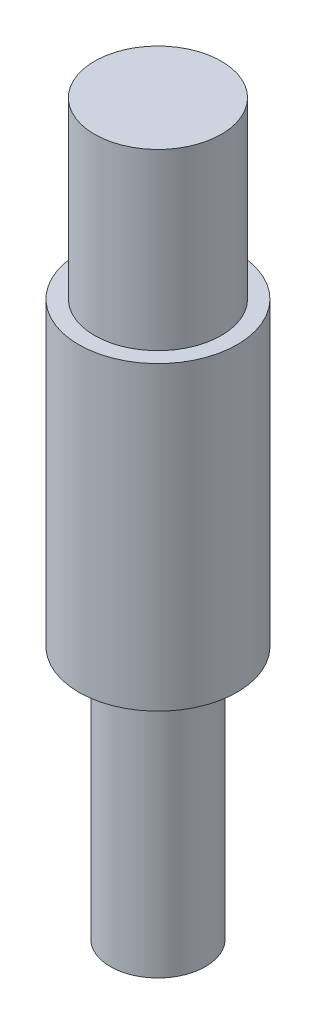
ISO-10303-21;
HEADER;
FILE_DESCRIPTION(('STEP AP214'),'2;1');
FILE_NAME('part.step','',(''),(''),'','','');
FILE_SCHEMA(('AUTOMOTIVE_DESIGN { 1 0 10303 214 1 1 1 1 }'));
ENDSEC;
DATA;
#1=APPLICATION_CONTEXT('core data for automotive mechanical design processes');
#2=APPLICATION_PROTOCOL_DEFINITION('international standard','automotive_design',2000,#1);
#3=PRODUCT_CONTEXT('',#1,'mechanical');
#4=PRODUCT('Part','Part','',(#3));
#5=PRODUCT_RELATED_PRODUCT_CATEGORY('part','',(#4));
#6=PRODUCT_DEFINITION_FORMATION('','',#4);
#7=PRODUCT_DEFINITION_CONTEXT('part definition',#1,'design');
#8=PRODUCT_DEFINITION('design','',#6,#7);
#9=PRODUCT_DEFINITION_SHAPE('','',#8);
#10=(LENGTH_UNIT() NAMED_UNIT(*) SI_UNIT(.MILLI.,.METRE.));
#11=(NAMED_UNIT(*) PLANE_ANGLE_UNIT() SI_UNIT($,.RADIAN.));
#12=(NAMED_UNIT(*) SI_UNIT($,.STERADIAN.) SOLID_ANGLE_UNIT());
#13=UNCERTAINTY_MEASURE_WITH_UNIT(LENGTH_MEASURE(1.E-05),#10,'distance_accuracy_value','');
#14=(GEOMETRIC_REPRESENTATION_CONTEXT(3) GLOBAL_UNCERTAINTY_ASSIGNED_CONTEXT((#13)) GLOBAL_UNIT_ASSIGNED_CONTEXT((#10,
#11,#12)) REPRESENTATION_CONTEXT('',''));
#15=CARTESIAN_POINT('',(0.,0.,0.));
#16=DIRECTION('',(0.,0.,1.));
#17=DIRECTION('',(1.,0.,0.));
#18=AXIS2_PLACEMENT_3D('',#15,#16,#17);
#19=CARTESIAN_POINT('',(0.,9.18603512762904,0.));
#20=DIRECTION('',(0.,1.,0.));
#21=DIRECTION('',(0.,0.,1.));
#22=AXIS2_PLACEMENT_3D('',#19,#20,#21);
#23=CYLINDRICAL_SURFACE('',#22,2.);
#24=CARTESIAN_POINT('',(0.,0.,0.));
#25=DIRECTION('',(0.,1.,0.));
#26=DIRECTION('',(0.,0.,1.));
#27=AXIS2_PLACEMENT_3D('',#24,#25,#26);
#28=CIRCLE('',#27,2.);
#29=CARTESIAN_POINT('',(0.,0.,2.));
#30=VERTEX_POINT('',#29);
#31=EDGE_CURVE('E10',#30,#30,#28,.T.);
#32=ORIENTED_EDGE('',*,*,#31,.F.);
#33=EDGE_LOOP('',(#32));
#34=FACE_BOUND('',#33,.T.);
#35=CARTESIAN_POINT('',(0.,-5.5,0.));
#36=DIRECTION('',(0.,1.,0.));
#37=DIRECTION('',(0.,0.,1.));
#38=AXIS2_PLACEMENT_3D('',#35,#36,#37);
#39=CIRCLE('',#38,2.);
#40=CARTESIAN_POINT('',(0.,-5.5,2.));
#41=VERTEX_POINT('',#40);
#42=EDGE_CURVE('E58',#41,#41,#39,.T.);
#43=ORIENTED_EDGE('',*,*,#42,.T.);
#44=EDGE_LOOP('',(#43));
#45=FACE_BOUND('',#44,.T.);
#46=ADVANCED_FACE('F36',(#34,#45),#23,.T.);
#47=CARTESIAN_POINT('',(0.,0.,0.));
#48=DIRECTION('',(0.,-1.,0.));
#49=DIRECTION('',(0.,0.,-1.));
#50=AXIS2_PLACEMENT_3D('',#47,#48,#49);
#51=PLANE('',#50);
#52=ORIENTED_EDGE('',*,*,#31,.T.);
#53=EDGE_LOOP('',(#52));
#54=FACE_BOUND('',#53,.T.);
#55=ADVANCED_FACE('F88',(#54),#51,.F.);
#56=CARTESIAN_POINT('',(1.5,-23.,0.));
#57=DIRECTION('',(0.,1.,0.));
#58=DIRECTION('',(0.,0.,1.));
#59=AXIS2_PLACEMENT_3D('',#56,#57,#58);
#60=PLANE('',#59);
#61=CARTESIAN_POINT('',(0.,-23.,0.));
#62=DIRECTION('',(0.,1.,0.));
#63=DIRECTION('',(0.,0.,1.));
#64=AXIS2_PLACEMENT_3D('',#61,#62,#63);
#65=CIRCLE('',#64,1.5);
#66=CARTESIAN_POINT('',(0.,-23.,1.5));
#67=VERTEX_POINT('',#66);
#68=EDGE_CURVE('E42',#67,#67,#65,.T.);
#69=ORIENTED_EDGE('',*,*,#68,.F.);
#70=EDGE_LOOP('',(#69));
#71=FACE_BOUND('',#70,.T.);
#72=ADVANCED_FACE('F83',(#71),#60,.F.);
#73=CARTESIAN_POINT('',(0.,9.18603512762904,0.));
#74=DIRECTION('',(0.,1.,0.));
#75=DIRECTION('',(0.,0.,1.));
#76=AXIS2_PLACEMENT_3D('',#73,#74,#75);
#77=CYLINDRICAL_SURFACE('',#76,1.5);
#78=CARTESIAN_POINT('',(0.,-15.,0.));
#79=DIRECTION('',(0.,1.,0.));
#80=DIRECTION('',(0.,0.,1.));
#81=AXIS2_PLACEMENT_3D('',#78,#79,#80);
#82=CIRCLE('',#81,1.5);
#83=CARTESIAN_POINT('',(0.,-15.,1.5));
#84=VERTEX_POINT('',#83);
#85=EDGE_CURVE('E46',#84,#84,#82,.T.);
#86=ORIENTED_EDGE('',*,*,#85,.F.);
#87=EDGE_LOOP('',(#86));
#88=FACE_BOUND('',#87,.T.);
#89=ORIENTED_EDGE('',*,*,#68,.T.);
#90=EDGE_LOOP('',(#89));
#91=FACE_BOUND('',#90,.T.);
#92=ADVANCED_FACE('F78',(#88,#91),#77,.T.);
#93=CARTESIAN_POINT('',(2.5,-15.,0.));
#94=DIRECTION('',(0.,1.,0.));
#95=DIRECTION('',(0.,0.,1.));
#96=AXIS2_PLACEMENT_3D('',#93,#94,#95);
#97=PLANE('',#96);
#98=CARTESIAN_POINT('',(0.,-15.,0.));
#99=DIRECTION('',(0.,1.,0.));
#100=DIRECTION('',(0.,0.,1.));
#101=AXIS2_PLACEMENT_3D('',#98,#99,#100);
#102=CIRCLE('',#101,2.5);
#103=CARTESIAN_POINT('',(0.,-15.,2.5));
#104=VERTEX_POINT('',#103);
#105=EDGE_CURVE('E50',#104,#104,#102,.T.);
#106=ORIENTED_EDGE('',*,*,#105,.F.);
#107=EDGE_LOOP('',(#106));
#108=FACE_BOUND('',#107,.T.);
#109=ORIENTED_EDGE('',*,*,#85,.T.);
#110=EDGE_LOOP('',(#109));
#111=FACE_BOUND('',#110,.T.);
#112=ADVANCED_FACE('F72',(#108,#111),#97,.F.);
#113=CARTESIAN_POINT('',(0.,9.18603512762904,0.));
#114=DIRECTION('',(0.,1.,0.));
#115=DIRECTION('',(0.,0.,1.));
#116=AXIS2_PLACEMENT_3D('',#113,#114,#115);
#117=CYLINDRICAL_SURFACE('',#116,2.5);
#118=CARTESIAN_POINT('',(0.,-5.5,0.));
#119=DIRECTION('',(0.,1.,0.));
#120=DIRECTION('',(0.,0.,1.));
#121=AXIS2_PLACEMENT_3D('',#118,#119,#120);
#122=CIRCLE('',#121,2.5);
#123=CARTESIAN_POINT('',(0.,-5.5,2.5));
#124=VERTEX_POINT('',#123);
#125=EDGE_CURVE('E55',#124,#124,#122,.T.);
#126=ORIENTED_EDGE('',*,*,#125,.F.);
#127=EDGE_LOOP('',(#126));
#128=FACE_BOUND('',#127,.T.);
#129=ORIENTED_EDGE('',*,*,#105,.T.);
#130=EDGE_LOOP('',(#129));
#131=FACE_BOUND('',#130,.T.);
#132=ADVANCED_FACE('F66',(#128,#131),#117,.T.);
#133=CARTESIAN_POINT('',(2.,-5.5,0.));
#134=DIRECTION('',(0.,-1.,0.));
#135=DIRECTION('',(0.,0.,-1.));
#136=AXIS2_PLACEMENT_3D('',#133,#134,#135);
#137=PLANE('',#136);
#138=ORIENTED_EDGE('',*,*,#42,.F.);
#139=EDGE_LOOP('',(#138));
#140=FACE_BOUND('',#139,.T.);
#141=ORIENTED_EDGE('',*,*,#125,.T.);
#142=EDGE_LOOP('',(#141));
#143=FACE_BOUND('',#142,.T.);
#144=ADVANCED_FACE('F63',(#140,#143),#137,.F.);
#145=CLOSED_SHELL('',(#46,#55,#72,#92,#112,#132,#144));
#146=MANIFOLD_SOLID_BREP('B2',#145);
#147=ADVANCED_BREP_SHAPE_REPRESENTATION('',(#18,#146),#14);
#148=SHAPE_DEFINITION_REPRESENTATION(#9,#147);
ENDSEC;
END-ISO-10303-21;
